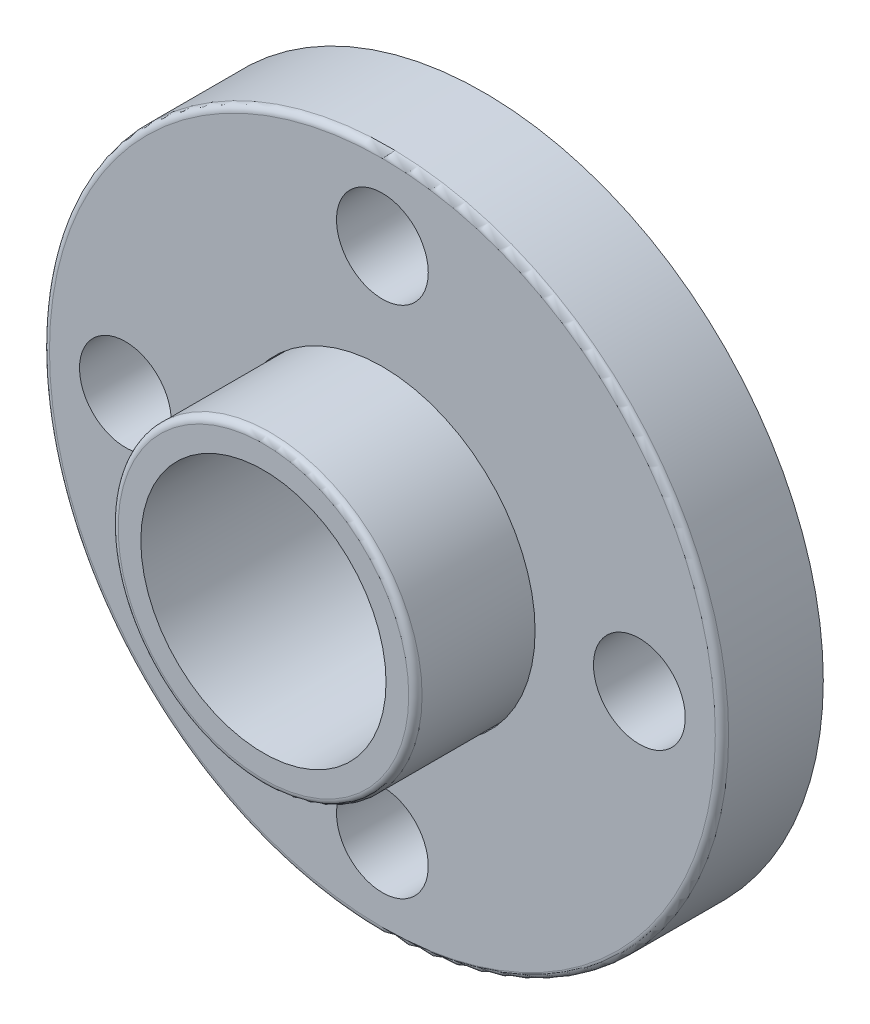
ISO-10303-21;
HEADER;
FILE_DESCRIPTION(('STEP AP214'),'2;1');
FILE_NAME('part.step','',(''),(''),'','','');
FILE_SCHEMA(('AUTOMOTIVE_DESIGN { 1 0 10303 214 1 1 1 1 }'));
ENDSEC;
DATA;
#1=APPLICATION_CONTEXT('core data for automotive mechanical design processes');
#2=APPLICATION_PROTOCOL_DEFINITION('international standard','automotive_design',2000,#1);
#3=PRODUCT_CONTEXT('',#1,'mechanical');
#4=PRODUCT('Part','Part','',(#3));
#5=PRODUCT_RELATED_PRODUCT_CATEGORY('part','',(#4));
#6=PRODUCT_DEFINITION_FORMATION('','',#4);
#7=PRODUCT_DEFINITION_CONTEXT('part definition',#1,'design');
#8=PRODUCT_DEFINITION('design','',#6,#7);
#9=PRODUCT_DEFINITION_SHAPE('','',#8);
#10=(LENGTH_UNIT() NAMED_UNIT(*) SI_UNIT(.MILLI.,.METRE.));
#11=(NAMED_UNIT(*) PLANE_ANGLE_UNIT() SI_UNIT($,.RADIAN.));
#12=(NAMED_UNIT(*) SI_UNIT($,.STERADIAN.) SOLID_ANGLE_UNIT());
#13=UNCERTAINTY_MEASURE_WITH_UNIT(LENGTH_MEASURE(1.E-05),#10,'distance_accuracy_value','');
#14=(GEOMETRIC_REPRESENTATION_CONTEXT(3) GLOBAL_UNCERTAINTY_ASSIGNED_CONTEXT((#13)) GLOBAL_UNIT_ASSIGNED_CONTEXT((#10,
#11,#12)) REPRESENTATION_CONTEXT('',''));
#15=CARTESIAN_POINT('',(0.,0.,0.));
#16=DIRECTION('',(0.,0.,1.));
#17=DIRECTION('',(1.,0.,0.));
#18=AXIS2_PLACEMENT_3D('',#15,#16,#17);
#19=CARTESIAN_POINT('',(0.,0.,0.));
#20=DIRECTION('',(0.,0.,-1.));
#21=DIRECTION('',(-1.,0.,0.));
#22=AXIS2_PLACEMENT_3D('',#19,#20,#21);
#23=CYLINDRICAL_SURFACE('',#22,26.416);
#24=CARTESIAN_POINT('',(0.,0.,8.31272727272727));
#25=DIRECTION('',(0.,0.,-1.));
#26=DIRECTION('',(-1.,0.,0.));
#27=AXIS2_PLACEMENT_3D('',#24,#25,#26);
#28=CIRCLE('',#27,26.416);
#29=CARTESIAN_POINT('',(-26.416,0.,8.31272727272727));
#30=VERTEX_POINT('',#29);
#31=EDGE_CURVE('E63',#30,#30,#28,.T.);
#32=ORIENTED_EDGE('',*,*,#31,.T.);
#33=EDGE_LOOP('',(#32));
#34=FACE_BOUND('',#33,.T.);
#35=CARTESIAN_POINT('',(0.,0.,17.526));
#36=DIRECTION('',(0.,0.,-1.));
#37=DIRECTION('',(-1.,0.,0.));
#38=AXIS2_PLACEMENT_3D('',#35,#36,#37);
#39=CIRCLE('',#38,26.416);
#40=CARTESIAN_POINT('',(-26.416,0.,17.526));
#41=VERTEX_POINT('',#40);
#42=EDGE_CURVE('E58',#41,#41,#39,.T.);
#43=ORIENTED_EDGE('',*,*,#42,.F.);
#44=EDGE_LOOP('',(#43));
#45=FACE_BOUND('',#44,.T.);
#46=ADVANCED_FACE('F40',(#34,#45),#23,.F.);
#47=CARTESIAN_POINT('',(0.,26.289,8.31272727272727));
#48=DIRECTION('',(0.,0.,-1.));
#49=DIRECTION('',(-1.,0.,0.));
#50=AXIS2_PLACEMENT_3D('',#47,#48,#49);
#51=PLANE('',#50);
#52=CARTESIAN_POINT('',(0.,0.,8.31272727272727));
#53=DIRECTION('',(0.,0.,-1.));
#54=DIRECTION('',(-1.,0.,0.));
#55=AXIS2_PLACEMENT_3D('',#52,#53,#54);
#56=CIRCLE('',#55,30.2895);
#57=CARTESIAN_POINT('',(-30.2895,0.,8.31272727272727));
#58=VERTEX_POINT('',#57);
#59=EDGE_CURVE('E65',#58,#58,#56,.T.);
#60=ORIENTED_EDGE('',*,*,#59,.T.);
#61=EDGE_LOOP('',(#60));
#62=FACE_BOUND('',#61,.T.);
#63=ORIENTED_EDGE('',*,*,#31,.F.);
#64=EDGE_LOOP('',(#63));
#65=FACE_BOUND('',#64,.T.);
#66=ADVANCED_FACE('F121',(#62,#65),#51,.T.);
#67=CARTESIAN_POINT('',(0.,0.,0.));
#68=DIRECTION('',(0.,0.,-1.));
#69=DIRECTION('',(-1.,0.,0.));
#70=AXIS2_PLACEMENT_3D('',#67,#68,#69);
#71=CYLINDRICAL_SURFACE('',#70,30.2895);
#72=CARTESIAN_POINT('',(0.,0.,0.));
#73=DIRECTION('',(0.,0.,-1.));
#74=DIRECTION('',(-1.,0.,0.));
#75=AXIS2_PLACEMENT_3D('',#72,#73,#74);
#76=CIRCLE('',#75,30.2895);
#77=CARTESIAN_POINT('',(-30.2895,0.,0.));
#78=VERTEX_POINT('',#77);
#79=EDGE_CURVE('E44',#78,#78,#76,.T.);
#80=ORIENTED_EDGE('',*,*,#79,.T.);
#81=EDGE_LOOP('',(#80));
#82=FACE_BOUND('',#81,.T.);
#83=ORIENTED_EDGE('',*,*,#59,.F.);
#84=EDGE_LOOP('',(#83));
#85=FACE_BOUND('',#84,.T.);
#86=ADVANCED_FACE('F107',(#82,#85),#71,.F.);
#87=CARTESIAN_POINT('',(0.,0.,16.3714545454545));
#88=DIRECTION('',(0.,0.,1.));
#89=DIRECTION('',(1.,0.,0.));
#90=AXIS2_PLACEMENT_3D('',#87,#88,#89);
#91=TOROIDAL_SURFACE('',#90,57.5829545454545,1.15454545454545);
#92=CARTESIAN_POINT('',(0.,0.,16.3714545454545));
#93=DIRECTION('',(0.,0.,1.));
#94=DIRECTION('',(1.,0.,0.));
#95=AXIS2_PLACEMENT_3D('',#92,#93,#94);
#96=CIRCLE('',#95,58.7375);
#97=CARTESIAN_POINT('',(58.7375,0.,16.3714545454545));
#98=VERTEX_POINT('',#97);
#99=EDGE_CURVE('E92',#98,#98,#96,.F.);
#100=ORIENTED_EDGE('',*,*,#99,.F.);
#101=EDGE_LOOP('',(#100));
#102=FACE_BOUND('',#101,.T.);
#103=CARTESIAN_POINT('',(0.,0.,17.526));
#104=DIRECTION('',(0.,0.,1.));
#105=DIRECTION('',(1.,0.,0.));
#106=AXIS2_PLACEMENT_3D('',#103,#104,#105);
#107=CIRCLE('',#106,57.5829545454545);
#108=CARTESIAN_POINT('',(57.5829545454545,0.,17.526));
#109=VERTEX_POINT('',#108);
#110=EDGE_CURVE('E62',#109,#109,#107,.T.);
#111=ORIENTED_EDGE('',*,*,#110,.F.);
#112=EDGE_LOOP('',(#111));
#113=FACE_BOUND('',#112,.T.);
#114=ADVANCED_FACE('F103',(#102,#113),#91,.T.);
#115=CARTESIAN_POINT('',(44.45,4.65589036534732E-13,0.));
#116=DIRECTION('',(0.,0.,1.));
#117=DIRECTION('',(1.,0.,0.));
#118=AXIS2_PLACEMENT_3D('',#115,#116,#117);
#119=CYLINDRICAL_SURFACE('',#118,7.9375);
#120=CARTESIAN_POINT('',(44.45,4.65589036534732E-13,0.));
#121=DIRECTION('',(0.,0.,1.));
#122=DIRECTION('',(0.,-1.,0.));
#123=AXIS2_PLACEMENT_3D('',#120,#121,#122);
#124=CIRCLE('',#123,7.9375);
#125=CARTESIAN_POINT('',(44.4500000000001,-7.93749999999954,0.));
#126=VERTEX_POINT('',#125);
#127=EDGE_CURVE('E11',#126,#126,#124,.T.);
#128=ORIENTED_EDGE('',*,*,#127,.F.);
#129=EDGE_LOOP('',(#128));
#130=FACE_BOUND('',#129,.T.);
#131=CARTESIAN_POINT('',(44.45,4.65589036534732E-13,17.526));
#132=DIRECTION('',(0.,0.,1.));
#133=DIRECTION('',(0.,-1.,0.));
#134=AXIS2_PLACEMENT_3D('',#131,#132,#133);
#135=CIRCLE('',#134,7.9375);
#136=CARTESIAN_POINT('',(44.4500000000001,-7.93749999999954,17.526));
#137=VERTEX_POINT('',#136);
#138=EDGE_CURVE('E57',#137,#137,#135,.T.);
#139=ORIENTED_EDGE('',*,*,#138,.T.);
#140=EDGE_LOOP('',(#139));
#141=FACE_BOUND('',#140,.T.);
#142=ADVANCED_FACE('F106',(#130,#141),#119,.F.);
#143=CARTESIAN_POINT('',(3.10392691023155E-13,-44.45,0.));
#144=DIRECTION('',(0.,0.,1.));
#145=DIRECTION('',(1.,0.,0.));
#146=AXIS2_PLACEMENT_3D('',#143,#144,#145);
#147=CYLINDRICAL_SURFACE('',#146,7.9375);
#148=CARTESIAN_POINT('',(3.10392691023155E-13,-44.45,0.));
#149=DIRECTION('',(0.,0.,1.));
#150=DIRECTION('',(-1.,0.,0.));
#151=AXIS2_PLACEMENT_3D('',#148,#149,#150);
#152=CIRCLE('',#151,7.9375);
#153=CARTESIAN_POINT('',(-7.93749999999969,-44.4500000000001,0.));
#154=VERTEX_POINT('',#153);
#155=EDGE_CURVE('E48',#154,#154,#152,.T.);
#156=ORIENTED_EDGE('',*,*,#155,.F.);
#157=EDGE_LOOP('',(#156));
#158=FACE_BOUND('',#157,.T.);
#159=CARTESIAN_POINT('',(3.10392691023155E-13,-44.45,17.526));
#160=DIRECTION('',(0.,0.,1.));
#161=DIRECTION('',(-1.,0.,0.));
#162=AXIS2_PLACEMENT_3D('',#159,#160,#161);
#163=CIRCLE('',#162,7.9375);
#164=CARTESIAN_POINT('',(-7.93749999999969,-44.4500000000001,17.526));
#165=VERTEX_POINT('',#164);
#166=EDGE_CURVE('E73',#165,#165,#163,.T.);
#167=ORIENTED_EDGE('',*,*,#166,.T.);
#168=EDGE_LOOP('',(#167));
#169=FACE_BOUND('',#168,.T.);
#170=ADVANCED_FACE('F146',(#158,#169),#147,.F.);
#171=CARTESIAN_POINT('',(-44.45,-1.55196345511577E-13,0.));
#172=DIRECTION('',(0.,0.,1.));
#173=DIRECTION('',(1.,0.,0.));
#174=AXIS2_PLACEMENT_3D('',#171,#172,#173);
#175=CYLINDRICAL_SURFACE('',#174,7.9375);
#176=CARTESIAN_POINT('',(-44.45,-1.55196345511577E-13,0.));
#177=DIRECTION('',(0.,0.,1.));
#178=DIRECTION('',(0.,1.,0.));
#179=AXIS2_PLACEMENT_3D('',#176,#177,#178);
#180=CIRCLE('',#179,7.9375);
#181=CARTESIAN_POINT('',(-44.45,7.93749999999985,0.));
#182=VERTEX_POINT('',#181);
#183=EDGE_CURVE('E53',#182,#182,#180,.T.);
#184=ORIENTED_EDGE('',*,*,#183,.F.);
#185=EDGE_LOOP('',(#184));
#186=FACE_BOUND('',#185,.T.);
#187=CARTESIAN_POINT('',(-44.45,-1.55196345511577E-13,17.526));
#188=DIRECTION('',(0.,0.,1.));
#189=DIRECTION('',(0.,1.,0.));
#190=AXIS2_PLACEMENT_3D('',#187,#188,#189);
#191=CIRCLE('',#190,7.9375);
#192=CARTESIAN_POINT('',(-44.45,7.93749999999985,17.526));
#193=VERTEX_POINT('',#192);
#194=EDGE_CURVE('E77',#193,#193,#191,.T.);
#195=ORIENTED_EDGE('',*,*,#194,.T.);
#196=EDGE_LOOP('',(#195));
#197=FACE_BOUND('',#196,.T.);
#198=ADVANCED_FACE('F115',(#186,#197),#175,.F.);
#199=CARTESIAN_POINT('',(0.,0.,17.526));
#200=DIRECTION('',(0.,0.,1.));
#201=DIRECTION('',(1.,0.,0.));
#202=AXIS2_PLACEMENT_3D('',#199,#200,#201);
#203=PLANE('',#202);
#204=CARTESIAN_POINT('',(0.,44.45,17.526));
#205=DIRECTION('',(0.,0.,1.));
#206=DIRECTION('',(1.,0.,0.));
#207=AXIS2_PLACEMENT_3D('',#204,#205,#206);
#208=CIRCLE('',#207,7.9375);
#209=CARTESIAN_POINT('',(7.9375,44.45,17.526));
#210=VERTEX_POINT('',#209);
#211=EDGE_CURVE('E61',#210,#210,#208,.T.);
#212=ORIENTED_EDGE('',*,*,#211,.F.);
#213=EDGE_LOOP('',(#212));
#214=FACE_BOUND('',#213,.T.);
#215=ORIENTED_EDGE('',*,*,#194,.F.);
#216=EDGE_LOOP('',(#215));
#217=FACE_BOUND('',#216,.T.);
#218=ORIENTED_EDGE('',*,*,#166,.F.);
#219=EDGE_LOOP('',(#218));
#220=FACE_BOUND('',#219,.T.);
#221=ORIENTED_EDGE('',*,*,#138,.F.);
#222=EDGE_LOOP('',(#221));
#223=FACE_BOUND('',#222,.T.);
#224=ORIENTED_EDGE('',*,*,#110,.T.);
#225=EDGE_LOOP('',(#224));
#226=FACE_BOUND('',#225,.T.);
#227=ORIENTED_EDGE('',*,*,#42,.T.);
#228=EDGE_LOOP('',(#227));
#229=FACE_BOUND('',#228,.T.);
#230=ADVANCED_FACE('F111',(#214,#217,#220,#223,#226,#229),#203,.T.);
#231=CARTESIAN_POINT('',(0.,44.45,0.));
#232=DIRECTION('',(0.,0.,1.));
#233=DIRECTION('',(1.,0.,0.));
#234=AXIS2_PLACEMENT_3D('',#231,#232,#233);
#235=CYLINDRICAL_SURFACE('',#234,7.9375);
#236=CARTESIAN_POINT('',(0.,44.45,0.));
#237=DIRECTION('',(0.,0.,1.));
#238=DIRECTION('',(1.,0.,0.));
#239=AXIS2_PLACEMENT_3D('',#236,#237,#238);
#240=CIRCLE('',#239,7.9375);
#241=CARTESIAN_POINT('',(7.9375,44.45,0.));
#242=VERTEX_POINT('',#241);
#243=EDGE_CURVE('E85',#242,#242,#240,.T.);
#244=ORIENTED_EDGE('',*,*,#243,.F.);
#245=EDGE_LOOP('',(#244));
#246=FACE_BOUND('',#245,.T.);
#247=ORIENTED_EDGE('',*,*,#211,.T.);
#248=EDGE_LOOP('',(#247));
#249=FACE_BOUND('',#248,.T.);
#250=ADVANCED_FACE('F114',(#246,#249),#235,.F.);
#251=CARTESIAN_POINT('',(0.,0.,17.526));
#252=DIRECTION('',(0.,0.,-1.));
#253=DIRECTION('',(-1.,0.,0.));
#254=AXIS2_PLACEMENT_3D('',#251,#252,#253);
#255=CYLINDRICAL_SURFACE('',#254,58.7375);
#256=ORIENTED_EDGE('',*,*,#99,.T.);
#257=EDGE_LOOP('',(#256));
#258=FACE_BOUND('',#257,.T.);
#259=CARTESIAN_POINT('',(0.,0.,0.));
#260=DIRECTION('',(0.,0.,1.));
#261=DIRECTION('',(1.,0.,0.));
#262=AXIS2_PLACEMENT_3D('',#259,#260,#261);
#263=CIRCLE('',#262,58.7375);
#264=CARTESIAN_POINT('',(58.7375,0.,0.));
#265=VERTEX_POINT('',#264);
#266=EDGE_CURVE('E89',#265,#265,#263,.T.);
#267=ORIENTED_EDGE('',*,*,#266,.T.);
#268=EDGE_LOOP('',(#267));
#269=FACE_BOUND('',#268,.T.);
#270=ADVANCED_FACE('F100',(#258,#269),#255,.T.);
#271=CARTESIAN_POINT('',(0.,0.,0.));
#272=DIRECTION('',(0.,0.,1.));
#273=DIRECTION('',(1.,0.,0.));
#274=AXIS2_PLACEMENT_3D('',#271,#272,#273);
#275=PLANE('',#274);
#276=ORIENTED_EDGE('',*,*,#266,.F.);
#277=EDGE_LOOP('',(#276));
#278=FACE_BOUND('',#277,.T.);
#279=ORIENTED_EDGE('',*,*,#243,.T.);
#280=EDGE_LOOP('',(#279));
#281=FACE_BOUND('',#280,.T.);
#282=ORIENTED_EDGE('',*,*,#183,.T.);
#283=EDGE_LOOP('',(#282));
#284=FACE_BOUND('',#283,.T.);
#285=ORIENTED_EDGE('',*,*,#155,.T.);
#286=EDGE_LOOP('',(#285));
#287=FACE_BOUND('',#286,.T.);
#288=ORIENTED_EDGE('',*,*,#127,.T.);
#289=EDGE_LOOP('',(#288));
#290=FACE_BOUND('',#289,.T.);
#291=ORIENTED_EDGE('',*,*,#79,.F.);
#292=EDGE_LOOP('',(#291));
#293=FACE_BOUND('',#292,.T.);
#294=ADVANCED_FACE('F42',(#278,#281,#284,#287,#290,#293),#275,.F.);
#295=CLOSED_SHELL('',(#46,#66,#86,#114,#142,#170,#198,#230,#250,#270,#294));
#296=MANIFOLD_SOLID_BREP('B2',#295);
#297=CARTESIAN_POINT('',(0.,0.,0.));
#298=DIRECTION('',(0.,0.,1.));
#299=DIRECTION('',(1.,0.,0.));
#300=AXIS2_PLACEMENT_3D('',#297,#298,#299);
#301=PLANE('',#300);
#302=CARTESIAN_POINT('',(0.,0.,0.));
#303=DIRECTION('',(0.,0.,-1.));
#304=DIRECTION('',(-1.,0.,0.));
#305=AXIS2_PLACEMENT_3D('',#302,#303,#304);
#306=CIRCLE('',#305,30.1625);
#307=CARTESIAN_POINT('',(-30.1625,0.,0.));
#308=VERTEX_POINT('',#307);
#309=EDGE_CURVE('E279',#308,#308,#306,.T.);
#310=ORIENTED_EDGE('',*,*,#309,.T.);
#311=EDGE_LOOP('',(#310));
#312=FACE_BOUND('',#311,.T.);
#313=CARTESIAN_POINT('',(0.,0.,0.));
#314=DIRECTION('',(0.,0.,1.));
#315=DIRECTION('',(1.,0.,0.));
#316=AXIS2_PLACEMENT_3D('',#313,#314,#315);
#317=CIRCLE('',#316,17.272);
#318=CARTESIAN_POINT('',(17.272,0.,0.));
#319=VERTEX_POINT('',#318);
#320=EDGE_CURVE('E262',#319,#319,#317,.T.);
#321=ORIENTED_EDGE('',*,*,#320,.T.);
#322=EDGE_LOOP('',(#321));
#323=FACE_BOUND('',#322,.T.);
#324=ADVANCED_FACE('F247',(#312,#323),#301,.F.);
#325=CARTESIAN_POINT('',(0.,0.,38.1));
#326=DIRECTION('',(0.,0.,-1.));
#327=DIRECTION('',(-1.,0.,0.));
#328=AXIS2_PLACEMENT_3D('',#325,#326,#327);
#329=CYLINDRICAL_SURFACE('',#328,26.289);
#330=CARTESIAN_POINT('',(0.,0.,36.9454545454545));
#331=DIRECTION('',(0.,0.,1.));
#332=DIRECTION('',(1.,0.,0.));
#333=AXIS2_PLACEMENT_3D('',#330,#331,#332);
#334=CIRCLE('',#333,26.289);
#335=CARTESIAN_POINT('',(26.289,0.,36.9454545454545));
#336=VERTEX_POINT('',#335);
#337=EDGE_CURVE('E39',#336,#336,#334,.F.);
#338=ORIENTED_EDGE('',*,*,#337,.T.);
#339=EDGE_LOOP('',(#338));
#340=FACE_BOUND('',#339,.T.);
#341=CARTESIAN_POINT('',(0.,0.,8.18572727272727));
#342=DIRECTION('',(0.,0.,-1.));
#343=DIRECTION('',(-1.,0.,0.));
#344=AXIS2_PLACEMENT_3D('',#341,#342,#343);
#345=CIRCLE('',#344,26.289);
#346=CARTESIAN_POINT('',(-26.289,0.,8.18572727272727));
#347=VERTEX_POINT('',#346);
#348=EDGE_CURVE('E276',#347,#347,#345,.T.);
#349=ORIENTED_EDGE('',*,*,#348,.F.);
#350=EDGE_LOOP('',(#349));
#351=FACE_BOUND('',#350,.T.);
#352=ADVANCED_FACE('F298',(#340,#351),#329,.T.);
#353=CARTESIAN_POINT('',(0.,0.,38.1));
#354=DIRECTION('',(0.,0.,1.));
#355=DIRECTION('',(1.,0.,0.));
#356=AXIS2_PLACEMENT_3D('',#353,#354,#355);
#357=PLANE('',#356);
#358=CARTESIAN_POINT('',(0.,0.,38.1));
#359=DIRECTION('',(0.,0.,1.));
#360=DIRECTION('',(1.,0.,0.));
#361=AXIS2_PLACEMENT_3D('',#358,#359,#360);
#362=CIRCLE('',#361,21.209);
#363=CARTESIAN_POINT('',(21.209,0.,38.1));
#364=VERTEX_POINT('',#363);
#365=EDGE_CURVE('E267',#364,#364,#362,.T.);
#366=ORIENTED_EDGE('',*,*,#365,.F.);
#367=EDGE_LOOP('',(#366));
#368=FACE_BOUND('',#367,.T.);
#369=CARTESIAN_POINT('',(0.,0.,38.1));
#370=DIRECTION('',(0.,0.,1.));
#371=DIRECTION('',(1.,0.,0.));
#372=AXIS2_PLACEMENT_3D('',#369,#370,#371);
#373=CIRCLE('',#372,25.1344545454545);
#374=CARTESIAN_POINT('',(25.1344545454545,0.,38.1));
#375=VERTEX_POINT('',#374);
#376=EDGE_CURVE('E254',#375,#375,#373,.T.);
#377=ORIENTED_EDGE('',*,*,#376,.T.);
#378=EDGE_LOOP('',(#377));
#379=FACE_BOUND('',#378,.T.);
#380=ADVANCED_FACE('F300',(#368,#379),#357,.T.);
#381=CARTESIAN_POINT('',(0.,0.,36.9454545454545));
#382=DIRECTION('',(0.,0.,1.));
#383=DIRECTION('',(1.,0.,0.));
#384=AXIS2_PLACEMENT_3D('',#381,#382,#383);
#385=TOROIDAL_SURFACE('',#384,25.1344545454545,1.15454545454545);
#386=ORIENTED_EDGE('',*,*,#337,.F.);
#387=EDGE_LOOP('',(#386));
#388=FACE_BOUND('',#387,.T.);
#389=ORIENTED_EDGE('',*,*,#376,.F.);
#390=EDGE_LOOP('',(#389));
#391=FACE_BOUND('',#390,.T.);
#392=ADVANCED_FACE('F249',(#388,#391),#385,.T.);
#393=CARTESIAN_POINT('',(0.,17.272,3.556));
#394=DIRECTION('',(0.,0.,-1.));
#395=DIRECTION('',(-1.,0.,0.));
#396=AXIS2_PLACEMENT_3D('',#393,#394,#395);
#397=PLANE('',#396);
#398=CARTESIAN_POINT('',(0.,0.,3.556));
#399=DIRECTION('',(0.,0.,1.));
#400=DIRECTION('',(1.,0.,0.));
#401=AXIS2_PLACEMENT_3D('',#398,#399,#400);
#402=CIRCLE('',#401,17.272);
#403=CARTESIAN_POINT('',(17.272,0.,3.556));
#404=VERTEX_POINT('',#403);
#405=EDGE_CURVE('E258',#404,#404,#402,.T.);
#406=ORIENTED_EDGE('',*,*,#405,.F.);
#407=EDGE_LOOP('',(#406));
#408=FACE_BOUND('',#407,.T.);
#409=CARTESIAN_POINT('',(0.,0.,3.556));
#410=DIRECTION('',(0.,0.,1.));
#411=DIRECTION('',(1.,0.,0.));
#412=AXIS2_PLACEMENT_3D('',#409,#410,#411);
#413=CIRCLE('',#412,21.0185);
#414=CARTESIAN_POINT('',(21.0185,0.,3.556));
#415=VERTEX_POINT('',#414);
#416=EDGE_CURVE('E270',#415,#415,#413,.T.);
#417=ORIENTED_EDGE('',*,*,#416,.T.);
#418=EDGE_LOOP('',(#417));
#419=FACE_BOUND('',#418,.T.);
#420=ADVANCED_FACE('F309',(#408,#419),#397,.F.);
#421=CARTESIAN_POINT('',(0.,0.,38.1));
#422=DIRECTION('',(0.,0.,1.));
#423=DIRECTION('',(1.,0.,0.));
#424=AXIS2_PLACEMENT_3D('',#421,#422,#423);
#425=CYLINDRICAL_SURFACE('',#424,17.272);
#426=ORIENTED_EDGE('',*,*,#320,.F.);
#427=EDGE_LOOP('',(#426));
#428=FACE_BOUND('',#427,.T.);
#429=ORIENTED_EDGE('',*,*,#405,.T.);
#430=EDGE_LOOP('',(#429));
#431=FACE_BOUND('',#430,.T.);
#432=ADVANCED_FACE('F312',(#428,#431),#425,.F.);
#433=CARTESIAN_POINT('',(0.,0.,38.1));
#434=DIRECTION('',(0.,0.,1.));
#435=DIRECTION('',(1.,0.,0.));
#436=AXIS2_PLACEMENT_3D('',#433,#434,#435);
#437=CONICAL_SURFACE('',#436,21.209,0.00551464997899612);
#438=ORIENTED_EDGE('',*,*,#416,.F.);
#439=EDGE_LOOP('',(#438));
#440=FACE_BOUND('',#439,.T.);
#441=ORIENTED_EDGE('',*,*,#365,.T.);
#442=EDGE_LOOP('',(#441));
#443=FACE_BOUND('',#442,.T.);
#444=ADVANCED_FACE('F289',(#440,#443),#437,.F.);
#445=CARTESIAN_POINT('',(0.,0.,0.));
#446=DIRECTION('',(0.,0.,-1.));
#447=DIRECTION('',(-1.,0.,0.));
#448=AXIS2_PLACEMENT_3D('',#445,#446,#447);
#449=CYLINDRICAL_SURFACE('',#448,30.1625);
#450=ORIENTED_EDGE('',*,*,#309,.F.);
#451=EDGE_LOOP('',(#450));
#452=FACE_BOUND('',#451,.T.);
#453=CARTESIAN_POINT('',(0.,0.,8.18572727272726));
#454=DIRECTION('',(0.,0.,-1.));
#455=DIRECTION('',(-1.,0.,0.));
#456=AXIS2_PLACEMENT_3D('',#453,#454,#455);
#457=CIRCLE('',#456,30.1625);
#458=CARTESIAN_POINT('',(-30.1625,0.,8.18572727272726));
#459=VERTEX_POINT('',#458);
#460=EDGE_CURVE('E273',#459,#459,#457,.T.);
#461=ORIENTED_EDGE('',*,*,#460,.T.);
#462=EDGE_LOOP('',(#461));
#463=FACE_BOUND('',#462,.T.);
#464=ADVANCED_FACE('F285',(#452,#463),#449,.T.);
#465=CARTESIAN_POINT('',(0.,26.289,8.18572727272727));
#466=DIRECTION('',(0.,0.,-1.));
#467=DIRECTION('',(-1.,0.,0.));
#468=AXIS2_PLACEMENT_3D('',#465,#466,#467);
#469=PLANE('',#468);
#470=ORIENTED_EDGE('',*,*,#460,.F.);
#471=EDGE_LOOP('',(#470));
#472=FACE_BOUND('',#471,.T.);
#473=ORIENTED_EDGE('',*,*,#348,.T.);
#474=EDGE_LOOP('',(#473));
#475=FACE_BOUND('',#474,.T.);
#476=ADVANCED_FACE('F288',(#472,#475),#469,.F.);
#477=CLOSED_SHELL('',(#324,#352,#380,#392,#420,#432,#444,#464,#476));
#478=MANIFOLD_SOLID_BREP('B6',#477);
#479=ADVANCED_BREP_SHAPE_REPRESENTATION('',(#18,#296,#478),#14);
#480=SHAPE_DEFINITION_REPRESENTATION(#9,#479);
ENDSEC;
END-ISO-10303-21;
